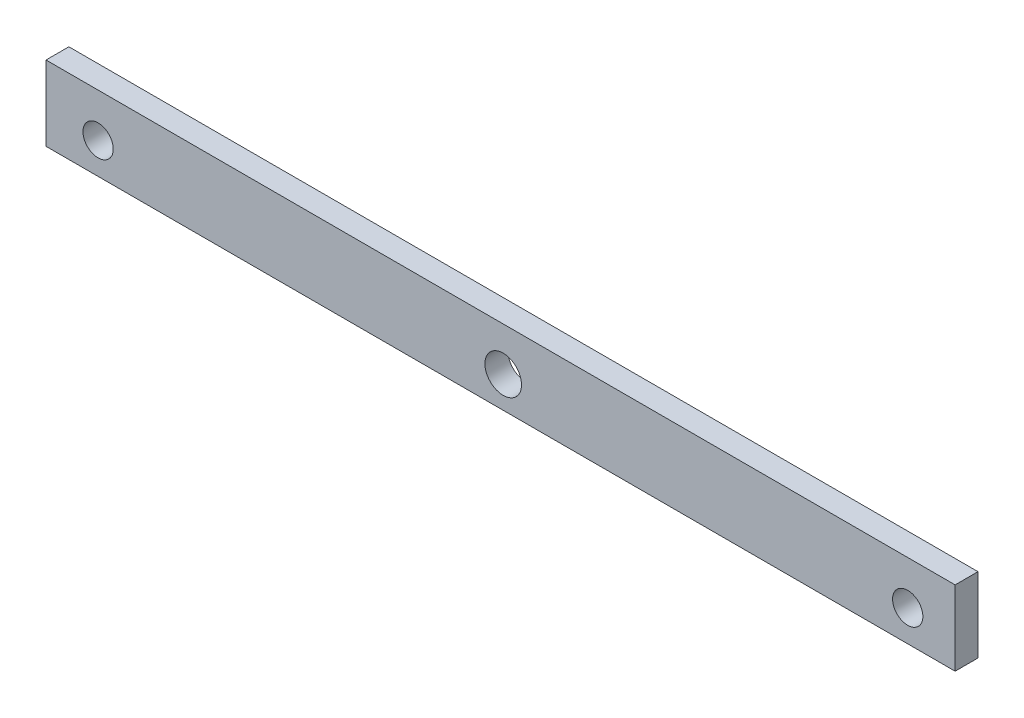
ISO-10303-21;
HEADER;
FILE_DESCRIPTION(('STEP AP214'),'2;1');
FILE_NAME('part.step','',(''),(''),'','','');
FILE_SCHEMA(('AUTOMOTIVE_DESIGN { 1 0 10303 214 1 1 1 1 }'));
ENDSEC;
DATA;
#1=APPLICATION_CONTEXT('core data for automotive mechanical design processes');
#2=APPLICATION_PROTOCOL_DEFINITION('international standard','automotive_design',2000,#1);
#3=PRODUCT_CONTEXT('',#1,'mechanical');
#4=PRODUCT('Part','Part','',(#3));
#5=PRODUCT_RELATED_PRODUCT_CATEGORY('part','',(#4));
#6=PRODUCT_DEFINITION_FORMATION('','',#4);
#7=PRODUCT_DEFINITION_CONTEXT('part definition',#1,'design');
#8=PRODUCT_DEFINITION('design','',#6,#7);
#9=PRODUCT_DEFINITION_SHAPE('','',#8);
#10=(LENGTH_UNIT() NAMED_UNIT(*) SI_UNIT(.MILLI.,.METRE.));
#11=(NAMED_UNIT(*) PLANE_ANGLE_UNIT() SI_UNIT($,.RADIAN.));
#12=(NAMED_UNIT(*) SI_UNIT($,.STERADIAN.) SOLID_ANGLE_UNIT());
#13=UNCERTAINTY_MEASURE_WITH_UNIT(LENGTH_MEASURE(1.E-05),#10,'distance_accuracy_value','');
#14=(GEOMETRIC_REPRESENTATION_CONTEXT(3) GLOBAL_UNCERTAINTY_ASSIGNED_CONTEXT((#13)) GLOBAL_UNIT_ASSIGNED_CONTEXT((#10,
#11,#12)) REPRESENTATION_CONTEXT('',''));
#15=CARTESIAN_POINT('',(0.,0.,0.));
#16=DIRECTION('',(0.,0.,1.));
#17=DIRECTION('',(1.,0.,0.));
#18=AXIS2_PLACEMENT_3D('',#15,#16,#17);
#19=CARTESIAN_POINT('',(-63.3190018331798,-289.90549861808,4.));
#20=DIRECTION('',(1.,0.,0.));
#21=DIRECTION('',(0.,0.,-1.));
#22=AXIS2_PLACEMENT_3D('',#19,#20,#21);
#23=PLANE('',#22);
#24=DIRECTION('',(0.,-1.,0.));
#25=VECTOR('',#24,1.);
#26=CARTESIAN_POINT('',(-63.3190018331798,-289.90549861808,0.));
#27=LINE('',#26,#25);
#28=CARTESIAN_POINT('',(-63.3190018331798,-289.90549861808,0.));
#29=VERTEX_POINT('',#28);
#30=CARTESIAN_POINT('',(-63.3190018331798,-302.983733182269,0.));
#31=VERTEX_POINT('',#30);
#32=EDGE_CURVE('E96',#29,#31,#27,.T.);
#33=ORIENTED_EDGE('',*,*,#32,.T.);
#34=DIRECTION('',(0.,0.,-1.));
#35=VECTOR('',#34,1.);
#36=CARTESIAN_POINT('',(-63.3190018331798,-302.983733182269,4.));
#37=LINE('',#36,#35);
#38=CARTESIAN_POINT('',(-63.3190018331798,-302.983733182269,4.));
#39=VERTEX_POINT('',#38);
#40=EDGE_CURVE('E11',#39,#31,#37,.T.);
#41=ORIENTED_EDGE('',*,*,#40,.F.);
#42=DIRECTION('',(0.,-1.,0.));
#43=VECTOR('',#42,1.);
#44=CARTESIAN_POINT('',(-63.3190018331798,-289.90549861808,4.));
#45=LINE('',#44,#43);
#46=CARTESIAN_POINT('',(-63.3190018331798,-289.90549861808,4.));
#47=VERTEX_POINT('',#46);
#48=EDGE_CURVE('E84',#47,#39,#45,.T.);
#49=ORIENTED_EDGE('',*,*,#48,.F.);
#50=DIRECTION('',(0.,0.,-1.));
#51=VECTOR('',#50,1.);
#52=CARTESIAN_POINT('',(-63.3190018331798,-289.90549861808,4.));
#53=LINE('',#52,#51);
#54=EDGE_CURVE('E92',#47,#29,#53,.T.);
#55=ORIENTED_EDGE('',*,*,#54,.T.);
#56=EDGE_LOOP('',(#33,#41,#49,#55));
#57=FACE_BOUND('',#56,.T.);
#58=ADVANCED_FACE('F33',(#57),#23,.F.);
#59=CARTESIAN_POINT('',(-63.3190018331798,-302.983733182269,4.));
#60=DIRECTION('',(0.,1.,0.));
#61=DIRECTION('',(0.,0.,1.));
#62=AXIS2_PLACEMENT_3D('',#59,#60,#61);
#63=PLANE('',#62);
#64=DIRECTION('',(1.,0.,0.));
#65=VECTOR('',#64,1.);
#66=CARTESIAN_POINT('',(-63.3190018331798,-302.983733182269,0.));
#67=LINE('',#66,#65);
#68=CARTESIAN_POINT('',(95.661649517771,-302.983733182269,0.));
#69=VERTEX_POINT('',#68);
#70=EDGE_CURVE('E88',#31,#69,#67,.T.);
#71=ORIENTED_EDGE('',*,*,#70,.T.);
#72=DIRECTION('',(0.,0.,-1.));
#73=VECTOR('',#72,1.);
#74=CARTESIAN_POINT('',(95.661649517771,-302.983733182269,4.));
#75=LINE('',#74,#73);
#76=CARTESIAN_POINT('',(95.661649517771,-302.983733182269,4.));
#77=VERTEX_POINT('',#76);
#78=EDGE_CURVE('E41',#77,#69,#75,.T.);
#79=ORIENTED_EDGE('',*,*,#78,.F.);
#80=DIRECTION('',(1.,0.,0.));
#81=VECTOR('',#80,1.);
#82=CARTESIAN_POINT('',(-63.3190018331798,-302.983733182269,4.));
#83=LINE('',#82,#81);
#84=EDGE_CURVE('E79',#39,#77,#83,.T.);
#85=ORIENTED_EDGE('',*,*,#84,.F.);
#86=ORIENTED_EDGE('',*,*,#40,.T.);
#87=EDGE_LOOP('',(#71,#79,#85,#86));
#88=FACE_BOUND('',#87,.T.);
#89=ADVANCED_FACE('F87',(#88),#63,.F.);
#90=CARTESIAN_POINT('',(95.661649517771,-289.90549861808,4.));
#91=DIRECTION('',(-1.,0.,0.));
#92=DIRECTION('',(0.,0.,1.));
#93=AXIS2_PLACEMENT_3D('',#90,#91,#92);
#94=PLANE('',#93);
#95=DIRECTION('',(0.,1.,0.));
#96=VECTOR('',#95,1.);
#97=CARTESIAN_POINT('',(95.661649517771,-289.90549861808,0.));
#98=LINE('',#97,#96);
#99=CARTESIAN_POINT('',(95.661649517771,-289.90549861808,0.));
#100=VERTEX_POINT('',#99);
#101=EDGE_CURVE('E66',#69,#100,#98,.T.);
#102=ORIENTED_EDGE('',*,*,#101,.T.);
#103=DIRECTION('',(0.,0.,-1.));
#104=VECTOR('',#103,1.);
#105=CARTESIAN_POINT('',(95.661649517771,-289.90549861808,4.));
#106=LINE('',#105,#104);
#107=CARTESIAN_POINT('',(95.661649517771,-289.90549861808,4.));
#108=VERTEX_POINT('',#107);
#109=EDGE_CURVE('E89',#108,#100,#106,.T.);
#110=ORIENTED_EDGE('',*,*,#109,.F.);
#111=DIRECTION('',(0.,1.,0.));
#112=VECTOR('',#111,1.);
#113=CARTESIAN_POINT('',(95.661649517771,-289.90549861808,4.));
#114=LINE('',#113,#112);
#115=EDGE_CURVE('E82',#77,#108,#114,.T.);
#116=ORIENTED_EDGE('',*,*,#115,.F.);
#117=ORIENTED_EDGE('',*,*,#78,.T.);
#118=EDGE_LOOP('',(#102,#110,#116,#117));
#119=FACE_BOUND('',#118,.T.);
#120=ADVANCED_FACE('F90',(#119),#94,.F.);
#121=CARTESIAN_POINT('',(-63.3190018331798,-289.90549861808,4.));
#122=DIRECTION('',(0.,-1.,0.));
#123=DIRECTION('',(0.,0.,-1.));
#124=AXIS2_PLACEMENT_3D('',#121,#122,#123);
#125=PLANE('',#124);
#126=DIRECTION('',(-1.,0.,0.));
#127=VECTOR('',#126,1.);
#128=CARTESIAN_POINT('',(-63.3190018331798,-289.90549861808,0.));
#129=LINE('',#128,#127);
#130=EDGE_CURVE('E72',#100,#29,#129,.T.);
#131=ORIENTED_EDGE('',*,*,#130,.T.);
#132=ORIENTED_EDGE('',*,*,#54,.F.);
#133=DIRECTION('',(-1.,0.,0.));
#134=VECTOR('',#133,1.);
#135=CARTESIAN_POINT('',(-63.3190018331798,-289.90549861808,4.));
#136=LINE('',#135,#134);
#137=EDGE_CURVE('E49',#108,#47,#136,.T.);
#138=ORIENTED_EDGE('',*,*,#137,.F.);
#139=ORIENTED_EDGE('',*,*,#109,.T.);
#140=EDGE_LOOP('',(#131,#132,#138,#139));
#141=FACE_BOUND('',#140,.T.);
#142=ADVANCED_FACE('F104',(#141),#125,.F.);
#143=CARTESIAN_POINT('',(0.,0.,4.));
#144=DIRECTION('',(0.,0.,1.));
#145=DIRECTION('',(1.,0.,0.));
#146=AXIS2_PLACEMENT_3D('',#143,#144,#145);
#147=PLANE('',#146);
#148=CARTESIAN_POINT('',(16.6347024436405,-297.523461342238,4.));
#149=DIRECTION('',(0.,0.,1.));
#150=DIRECTION('',(1.,0.,0.));
#151=AXIS2_PLACEMENT_3D('',#148,#149,#150);
#152=CIRCLE('',#151,3.2);
#153=CARTESIAN_POINT('',(19.8347024436405,-297.523461342238,4.));
#154=VERTEX_POINT('',#153);
#155=EDGE_CURVE('E124',#154,#154,#152,.T.);
#156=ORIENTED_EDGE('',*,*,#155,.F.);
#157=EDGE_LOOP('',(#156));
#158=FACE_BOUND('',#157,.T.);
#159=CARTESIAN_POINT('',(87.3709981668202,-297.523461342208,4.));
#160=DIRECTION('',(0.,0.,1.));
#161=DIRECTION('',(1.,0.,0.));
#162=AXIS2_PLACEMENT_3D('',#159,#160,#161);
#163=CIRCLE('',#162,2.65);
#164=CARTESIAN_POINT('',(90.0209981668202,-297.523461342208,4.));
#165=VERTEX_POINT('',#164);
#166=EDGE_CURVE('E118',#165,#165,#163,.T.);
#167=ORIENTED_EDGE('',*,*,#166,.F.);
#168=EDGE_LOOP('',(#167));
#169=FACE_BOUND('',#168,.T.);
#170=CARTESIAN_POINT('',(-54.2090018331798,-297.523461342238,4.));
#171=DIRECTION('',(0.,0.,1.));
#172=DIRECTION('',(1.,0.,0.));
#173=AXIS2_PLACEMENT_3D('',#170,#171,#172);
#174=CIRCLE('',#173,2.65);
#175=CARTESIAN_POINT('',(-51.5590018331798,-297.523461342238,4.));
#176=VERTEX_POINT('',#175);
#177=EDGE_CURVE('E112',#176,#176,#174,.T.);
#178=ORIENTED_EDGE('',*,*,#177,.F.);
#179=EDGE_LOOP('',(#178));
#180=FACE_BOUND('',#179,.T.);
#181=ORIENTED_EDGE('',*,*,#48,.T.);
#182=ORIENTED_EDGE('',*,*,#84,.T.);
#183=ORIENTED_EDGE('',*,*,#115,.T.);
#184=ORIENTED_EDGE('',*,*,#137,.T.);
#185=EDGE_LOOP('',(#181,#182,#183,#184));
#186=FACE_BOUND('',#185,.T.);
#187=ADVANCED_FACE('F80',(#158,#169,#180,#186),#147,.T.);
#188=CARTESIAN_POINT('',(0.,0.,0.));
#189=DIRECTION('',(0.,0.,1.));
#190=DIRECTION('',(1.,0.,0.));
#191=AXIS2_PLACEMENT_3D('',#188,#189,#190);
#192=PLANE('',#191);
#193=CARTESIAN_POINT('',(16.6347024436405,-297.523461342238,0.));
#194=DIRECTION('',(0.,0.,1.));
#195=DIRECTION('',(1.,0.,0.));
#196=AXIS2_PLACEMENT_3D('',#193,#194,#195);
#197=CIRCLE('',#196,3.2);
#198=CARTESIAN_POINT('',(19.8347024436405,-297.523461342238,0.));
#199=VERTEX_POINT('',#198);
#200=EDGE_CURVE('E121',#199,#199,#197,.T.);
#201=ORIENTED_EDGE('',*,*,#200,.T.);
#202=EDGE_LOOP('',(#201));
#203=FACE_BOUND('',#202,.T.);
#204=CARTESIAN_POINT('',(87.3709981668202,-297.523461342208,0.));
#205=DIRECTION('',(0.,0.,1.));
#206=DIRECTION('',(1.,0.,0.));
#207=AXIS2_PLACEMENT_3D('',#204,#205,#206);
#208=CIRCLE('',#207,2.65);
#209=CARTESIAN_POINT('',(90.0209981668202,-297.523461342208,0.));
#210=VERTEX_POINT('',#209);
#211=EDGE_CURVE('E115',#210,#210,#208,.T.);
#212=ORIENTED_EDGE('',*,*,#211,.T.);
#213=EDGE_LOOP('',(#212));
#214=FACE_BOUND('',#213,.T.);
#215=CARTESIAN_POINT('',(-54.2090018331798,-297.523461342238,0.));
#216=DIRECTION('',(0.,0.,1.));
#217=DIRECTION('',(1.,0.,0.));
#218=AXIS2_PLACEMENT_3D('',#215,#216,#217);
#219=CIRCLE('',#218,2.65);
#220=CARTESIAN_POINT('',(-51.5590018331798,-297.523461342238,0.));
#221=VERTEX_POINT('',#220);
#222=EDGE_CURVE('E99',#221,#221,#219,.T.);
#223=ORIENTED_EDGE('',*,*,#222,.T.);
#224=EDGE_LOOP('',(#223));
#225=FACE_BOUND('',#224,.T.);
#226=ORIENTED_EDGE('',*,*,#32,.F.);
#227=ORIENTED_EDGE('',*,*,#130,.F.);
#228=ORIENTED_EDGE('',*,*,#101,.F.);
#229=ORIENTED_EDGE('',*,*,#70,.F.);
#230=EDGE_LOOP('',(#226,#227,#228,#229));
#231=FACE_BOUND('',#230,.T.);
#232=ADVANCED_FACE('F107',(#203,#214,#225,#231),#192,.F.);
#233=CARTESIAN_POINT('',(-54.2090018331798,-297.523461342238,4.));
#234=DIRECTION('',(0.,0.,1.));
#235=DIRECTION('',(1.,0.,0.));
#236=AXIS2_PLACEMENT_3D('',#233,#234,#235);
#237=CYLINDRICAL_SURFACE('',#236,2.65);
#238=ORIENTED_EDGE('',*,*,#222,.F.);
#239=EDGE_LOOP('',(#238));
#240=FACE_BOUND('',#239,.T.);
#241=ORIENTED_EDGE('',*,*,#177,.T.);
#242=EDGE_LOOP('',(#241));
#243=FACE_BOUND('',#242,.T.);
#244=ADVANCED_FACE('F137',(#240,#243),#237,.F.);
#245=CARTESIAN_POINT('',(87.3709981668202,-297.523461342208,4.));
#246=DIRECTION('',(0.,0.,1.));
#247=DIRECTION('',(1.,0.,0.));
#248=AXIS2_PLACEMENT_3D('',#245,#246,#247);
#249=CYLINDRICAL_SURFACE('',#248,2.65);
#250=ORIENTED_EDGE('',*,*,#211,.F.);
#251=EDGE_LOOP('',(#250));
#252=FACE_BOUND('',#251,.T.);
#253=ORIENTED_EDGE('',*,*,#166,.T.);
#254=EDGE_LOOP('',(#253));
#255=FACE_BOUND('',#254,.T.);
#256=ADVANCED_FACE('F139',(#252,#255),#249,.F.);
#257=CARTESIAN_POINT('',(16.6347024436405,-297.523461342238,4.));
#258=DIRECTION('',(0.,0.,1.));
#259=DIRECTION('',(1.,0.,0.));
#260=AXIS2_PLACEMENT_3D('',#257,#258,#259);
#261=CYLINDRICAL_SURFACE('',#260,3.2);
#262=ORIENTED_EDGE('',*,*,#200,.F.);
#263=EDGE_LOOP('',(#262));
#264=FACE_BOUND('',#263,.T.);
#265=ORIENTED_EDGE('',*,*,#155,.T.);
#266=EDGE_LOOP('',(#265));
#267=FACE_BOUND('',#266,.T.);
#268=ADVANCED_FACE('F128',(#264,#267),#261,.F.);
#269=CLOSED_SHELL('',(#58,#89,#120,#142,#187,#232,#244,#256,#268));
#270=MANIFOLD_SOLID_BREP('B2',#269);
#271=ADVANCED_BREP_SHAPE_REPRESENTATION('',(#18,#270),#14);
#272=SHAPE_DEFINITION_REPRESENTATION(#9,#271);
ENDSEC;
END-ISO-10303-21;
